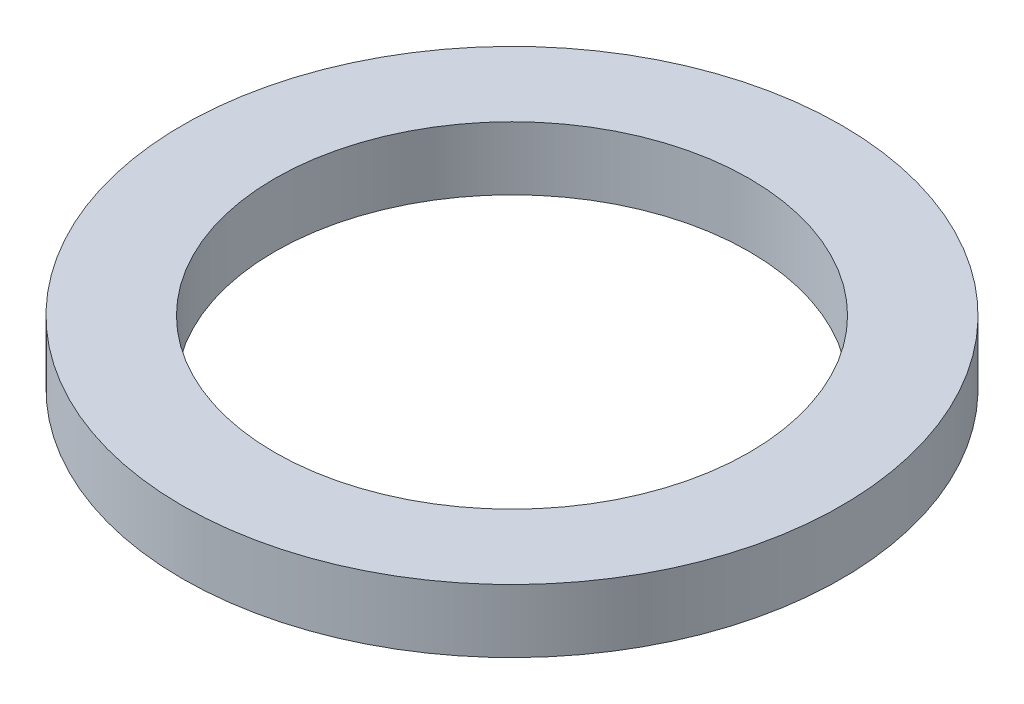
ISO-10303-21;
HEADER;
FILE_DESCRIPTION(('STEP AP214'),'2;1');
FILE_NAME('part.step','',(''),(''),'','','');
FILE_SCHEMA(('AUTOMOTIVE_DESIGN { 1 0 10303 214 1 1 1 1 }'));
ENDSEC;
DATA;
#1=APPLICATION_CONTEXT('core data for automotive mechanical design processes');
#2=APPLICATION_PROTOCOL_DEFINITION('international standard','automotive_design',2000,#1);
#3=PRODUCT_CONTEXT('',#1,'mechanical');
#4=PRODUCT('Part','Part','',(#3));
#5=PRODUCT_RELATED_PRODUCT_CATEGORY('part','',(#4));
#6=PRODUCT_DEFINITION_FORMATION('','',#4);
#7=PRODUCT_DEFINITION_CONTEXT('part definition',#1,'design');
#8=PRODUCT_DEFINITION('design','',#6,#7);
#9=PRODUCT_DEFINITION_SHAPE('','',#8);
#10=(LENGTH_UNIT() NAMED_UNIT(*) SI_UNIT(.MILLI.,.METRE.));
#11=(NAMED_UNIT(*) PLANE_ANGLE_UNIT() SI_UNIT($,.RADIAN.));
#12=(NAMED_UNIT(*) SI_UNIT($,.STERADIAN.) SOLID_ANGLE_UNIT());
#13=UNCERTAINTY_MEASURE_WITH_UNIT(LENGTH_MEASURE(1.E-05),#10,'distance_accuracy_value','');
#14=(GEOMETRIC_REPRESENTATION_CONTEXT(3) GLOBAL_UNCERTAINTY_ASSIGNED_CONTEXT((#13)) GLOBAL_UNIT_ASSIGNED_CONTEXT((#10,
#11,#12)) REPRESENTATION_CONTEXT('',''));
#15=CARTESIAN_POINT('',(0.,0.,0.));
#16=DIRECTION('',(0.,0.,1.));
#17=DIRECTION('',(1.,0.,0.));
#18=AXIS2_PLACEMENT_3D('',#15,#16,#17);
#19=CARTESIAN_POINT('',(0.,12.,0.));
#20=DIRECTION('',(0.,-1.,0.));
#21=DIRECTION('',(0.,0.,-1.));
#22=AXIS2_PLACEMENT_3D('',#19,#20,#21);
#23=CYLINDRICAL_SURFACE('',#22,62.5);
#24=CARTESIAN_POINT('',(0.,12.,0.));
#25=DIRECTION('',(0.,1.,0.));
#26=DIRECTION('',(0.,0.,1.));
#27=AXIS2_PLACEMENT_3D('',#24,#25,#26);
#28=CIRCLE('',#27,62.5);
#29=CARTESIAN_POINT('',(0.,12.,62.5));
#30=VERTEX_POINT('',#29);
#31=EDGE_CURVE('E10',#30,#30,#28,.T.);
#32=ORIENTED_EDGE('',*,*,#31,.F.);
#33=EDGE_LOOP('',(#32));
#34=FACE_BOUND('',#33,.T.);
#35=CARTESIAN_POINT('',(0.,0.,0.));
#36=DIRECTION('',(0.,1.,0.));
#37=DIRECTION('',(0.,0.,1.));
#38=AXIS2_PLACEMENT_3D('',#35,#36,#37);
#39=CIRCLE('',#38,62.5);
#40=CARTESIAN_POINT('',(0.,0.,62.5));
#41=VERTEX_POINT('',#40);
#42=EDGE_CURVE('E37',#41,#41,#39,.T.);
#43=ORIENTED_EDGE('',*,*,#42,.T.);
#44=EDGE_LOOP('',(#43));
#45=FACE_BOUND('',#44,.T.);
#46=ADVANCED_FACE('F40',(#34,#45),#23,.T.);
#47=CARTESIAN_POINT('',(0.,12.,0.));
#48=DIRECTION('',(0.,1.,0.));
#49=DIRECTION('',(0.,0.,1.));
#50=AXIS2_PLACEMENT_3D('',#47,#48,#49);
#51=PLANE('',#50);
#52=CARTESIAN_POINT('',(0.,12.,0.));
#53=DIRECTION('',(0.,1.,0.));
#54=DIRECTION('',(0.,0.,1.));
#55=AXIS2_PLACEMENT_3D('',#52,#53,#54);
#56=CIRCLE('',#55,45.);
#57=CARTESIAN_POINT('',(0.,12.,45.));
#58=VERTEX_POINT('',#57);
#59=EDGE_CURVE('E50',#58,#58,#56,.T.);
#60=ORIENTED_EDGE('',*,*,#59,.F.);
#61=EDGE_LOOP('',(#60));
#62=FACE_BOUND('',#61,.T.);
#63=ORIENTED_EDGE('',*,*,#31,.T.);
#64=EDGE_LOOP('',(#63));
#65=FACE_BOUND('',#64,.T.);
#66=ADVANCED_FACE('F59',(#62,#65),#51,.T.);
#67=CARTESIAN_POINT('',(0.,0.,0.));
#68=DIRECTION('',(0.,1.,0.));
#69=DIRECTION('',(0.,0.,1.));
#70=AXIS2_PLACEMENT_3D('',#67,#68,#69);
#71=PLANE('',#70);
#72=CARTESIAN_POINT('',(0.,0.,0.));
#73=DIRECTION('',(0.,1.,0.));
#74=DIRECTION('',(0.,0.,1.));
#75=AXIS2_PLACEMENT_3D('',#72,#73,#74);
#76=CIRCLE('',#75,45.);
#77=CARTESIAN_POINT('',(0.,0.,45.));
#78=VERTEX_POINT('',#77);
#79=EDGE_CURVE('E47',#78,#78,#76,.T.);
#80=ORIENTED_EDGE('',*,*,#79,.T.);
#81=EDGE_LOOP('',(#80));
#82=FACE_BOUND('',#81,.T.);
#83=ORIENTED_EDGE('',*,*,#42,.F.);
#84=EDGE_LOOP('',(#83));
#85=FACE_BOUND('',#84,.T.);
#86=ADVANCED_FACE('F58',(#82,#85),#71,.F.);
#87=CARTESIAN_POINT('',(0.,12.,0.));
#88=DIRECTION('',(0.,-1.,0.));
#89=DIRECTION('',(0.,0.,-1.));
#90=AXIS2_PLACEMENT_3D('',#87,#88,#89);
#91=CYLINDRICAL_SURFACE('',#90,45.);
#92=ORIENTED_EDGE('',*,*,#59,.T.);
#93=EDGE_LOOP('',(#92));
#94=FACE_BOUND('',#93,.T.);
#95=ORIENTED_EDGE('',*,*,#79,.F.);
#96=EDGE_LOOP('',(#95));
#97=FACE_BOUND('',#96,.T.);
#98=ADVANCED_FACE('F54',(#94,#97),#91,.F.);
#99=CLOSED_SHELL('',(#46,#66,#86,#98));
#100=MANIFOLD_SOLID_BREP('B2',#99);
#101=ADVANCED_BREP_SHAPE_REPRESENTATION('',(#18,#100),#14);
#102=SHAPE_DEFINITION_REPRESENTATION(#9,#101);
ENDSEC;
END-ISO-10303-21;
